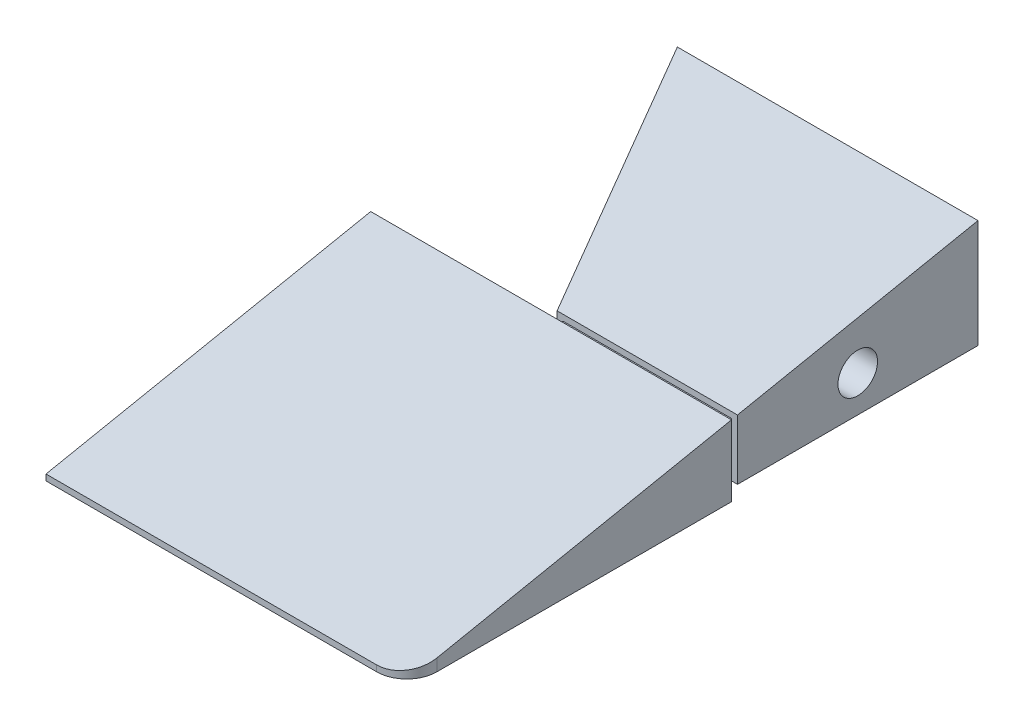
ISO-10303-21;
HEADER;
FILE_DESCRIPTION(('STEP AP214'),'2;1');
FILE_NAME('part.step','',(''),(''),'','','');
FILE_SCHEMA(('AUTOMOTIVE_DESIGN { 1 0 10303 214 1 1 1 1 }'));
ENDSEC;
DATA;
#1=APPLICATION_CONTEXT('core data for automotive mechanical design processes');
#2=APPLICATION_PROTOCOL_DEFINITION('international standard','automotive_design',2000,#1);
#3=PRODUCT_CONTEXT('',#1,'mechanical');
#4=PRODUCT('Part','Part','',(#3));
#5=PRODUCT_RELATED_PRODUCT_CATEGORY('part','',(#4));
#6=PRODUCT_DEFINITION_FORMATION('','',#4);
#7=PRODUCT_DEFINITION_CONTEXT('part definition',#1,'design');
#8=PRODUCT_DEFINITION('design','',#6,#7);
#9=PRODUCT_DEFINITION_SHAPE('','',#8);
#10=(LENGTH_UNIT() NAMED_UNIT(*) SI_UNIT(.MILLI.,.METRE.));
#11=(NAMED_UNIT(*) PLANE_ANGLE_UNIT() SI_UNIT($,.RADIAN.));
#12=(NAMED_UNIT(*) SI_UNIT($,.STERADIAN.) SOLID_ANGLE_UNIT());
#13=UNCERTAINTY_MEASURE_WITH_UNIT(LENGTH_MEASURE(1.E-05),#10,'distance_accuracy_value','');
#14=(GEOMETRIC_REPRESENTATION_CONTEXT(3) GLOBAL_UNCERTAINTY_ASSIGNED_CONTEXT((#13)) GLOBAL_UNIT_ASSIGNED_CONTEXT((#10,
#11,#12)) REPRESENTATION_CONTEXT('',''));
#15=CARTESIAN_POINT('',(0.,0.,0.));
#16=DIRECTION('',(0.,0.,1.));
#17=DIRECTION('',(1.,0.,0.));
#18=AXIS2_PLACEMENT_3D('',#15,#16,#17);
#19=CARTESIAN_POINT('',(35.,-10.001,41.));
#20=DIRECTION('',(0.,0.,-1.));
#21=DIRECTION('',(-1.,0.,0.));
#22=AXIS2_PLACEMENT_3D('',#19,#20,#21);
#23=PLANE('',#22);
#24=DIRECTION('',(-1.,0.,0.));
#25=VECTOR('',#24,1.);
#26=CARTESIAN_POINT('',(35.,1.79999999999998,41.));
#27=LINE('',#26,#25);
#28=CARTESIAN_POINT('',(65.,1.79999999999998,41.));
#29=VERTEX_POINT('',#28);
#30=CARTESIAN_POINT('',(5.,1.79999999999997,41.));
#31=VERTEX_POINT('',#30);
#32=EDGE_CURVE('E214',#29,#31,#27,.T.);
#33=ORIENTED_EDGE('',*,*,#32,.F.);
#34=DIRECTION('',(0.,-1.,0.));
#35=VECTOR('',#34,1.);
#36=CARTESIAN_POINT('',(65.,-10.,41.));
#37=LINE('',#36,#35);
#38=CARTESIAN_POINT('',(65.,-10.,41.));
#39=VERTEX_POINT('',#38);
#40=EDGE_CURVE('E192',#29,#39,#37,.T.);
#41=ORIENTED_EDGE('',*,*,#40,.T.);
#42=DIRECTION('',(1.,0.,0.));
#43=VECTOR('',#42,1.);
#44=CARTESIAN_POINT('',(35.,-10.,41.));
#45=LINE('',#44,#43);
#46=CARTESIAN_POINT('',(5.,-10.,41.));
#47=VERTEX_POINT('',#46);
#48=EDGE_CURVE('E221',#47,#39,#45,.T.);
#49=ORIENTED_EDGE('',*,*,#48,.F.);
#50=DIRECTION('',(0.,1.,0.));
#51=VECTOR('',#50,1.);
#52=CARTESIAN_POINT('',(5.,-10.001,41.));
#53=LINE('',#52,#51);
#54=EDGE_CURVE('E229',#47,#31,#53,.T.);
#55=ORIENTED_EDGE('',*,*,#54,.T.);
#56=EDGE_LOOP('',(#33,#41,#49,#55));
#57=FACE_BOUND('',#56,.T.);
#58=DIRECTION('',(-1.,0.,0.));
#59=VECTOR('',#58,1.);
#60=CARTESIAN_POINT('',(36.,-7.,41.));
#61=LINE('',#60,#59);
#62=CARTESIAN_POINT('',(64.,-7.,41.));
#63=VERTEX_POINT('',#62);
#64=CARTESIAN_POINT('',(36.,-7.,41.));
#65=VERTEX_POINT('',#64);
#66=EDGE_CURVE('E186',#63,#65,#61,.T.);
#67=ORIENTED_EDGE('',*,*,#66,.F.);
#68=DIRECTION('',(0.,-1.,0.));
#69=VECTOR('',#68,1.);
#70=CARTESIAN_POINT('',(64.,0.999999999999986,41.));
#71=LINE('',#70,#69);
#72=CARTESIAN_POINT('',(64.,0.999999999999986,41.));
#73=VERTEX_POINT('',#72);
#74=EDGE_CURVE('E178',#73,#63,#71,.T.);
#75=ORIENTED_EDGE('',*,*,#74,.F.);
#76=DIRECTION('',(1.,0.,0.));
#77=VECTOR('',#76,1.);
#78=CARTESIAN_POINT('',(36.,0.999999999999986,41.));
#79=LINE('',#78,#77);
#80=CARTESIAN_POINT('',(36.,0.999999999999986,41.));
#81=VERTEX_POINT('',#80);
#82=EDGE_CURVE('E182',#81,#73,#79,.T.);
#83=ORIENTED_EDGE('',*,*,#82,.F.);
#84=DIRECTION('',(0.,1.,0.));
#85=VECTOR('',#84,1.);
#86=CARTESIAN_POINT('',(36.,0.999999999999986,41.));
#87=LINE('',#86,#85);
#88=EDGE_CURVE('E184',#65,#81,#87,.T.);
#89=ORIENTED_EDGE('',*,*,#88,.F.);
#90=EDGE_LOOP('',(#67,#75,#83,#89));
#91=FACE_BOUND('',#90,.T.);
#92=ADVANCED_FACE('F34',(#57,#91),#23,.T.);
#93=CARTESIAN_POINT('',(60.,0.,90.));
#94=DIRECTION('',(0.,-1.,0.));
#95=DIRECTION('',(0.,0.,-1.));
#96=AXIS2_PLACEMENT_3D('',#93,#94,#95);
#97=CYLINDRICAL_SURFACE('',#96,5.);
#98=CARTESIAN_POINT('',(60.,-10.,90.));
#99=DIRECTION('',(0.,1.,0.));
#100=DIRECTION('',(0.,0.,1.));
#101=AXIS2_PLACEMENT_3D('',#98,#99,#100);
#102=CIRCLE('',#101,5.);
#103=CARTESIAN_POINT('',(65.,-10.,90.));
#104=VERTEX_POINT('',#103);
#105=CARTESIAN_POINT('',(60.,-10.,95.));
#106=VERTEX_POINT('',#105);
#107=EDGE_CURVE('E42',#104,#106,#102,.F.);
#108=ORIENTED_EDGE('',*,*,#107,.F.);
#109=DIRECTION('',(0.,1.,0.));
#110=VECTOR('',#109,1.);
#111=CARTESIAN_POINT('',(65.,-10.,90.));
#112=LINE('',#111,#110);
#113=CARTESIAN_POINT('',(65.,-8.,90.));
#114=VERTEX_POINT('',#113);
#115=EDGE_CURVE('E244',#114,#104,#112,.F.);
#116=ORIENTED_EDGE('',*,*,#115,.F.);
#117=CARTESIAN_POINT('',(60.,-8.,90.));
#118=DIRECTION('',(0.,-0.98058067569092,-0.196116135138184));
#119=DIRECTION('',(0.,-0.196116135138184,0.98058067569092));
#120=AXIS2_PLACEMENT_3D('',#117,#118,#119);
#121=ELLIPSE('',#120,5.09901951359278,5.);
#122=CARTESIAN_POINT('',(60.,-9.,95.));
#123=VERTEX_POINT('',#122);
#124=EDGE_CURVE('E241',#123,#114,#121,.F.);
#125=ORIENTED_EDGE('',*,*,#124,.F.);
#126=DIRECTION('',(0.,1.,0.));
#127=VECTOR('',#126,1.);
#128=CARTESIAN_POINT('',(60.,-9.,95.));
#129=LINE('',#128,#127);
#130=EDGE_CURVE('E238',#106,#123,#129,.T.);
#131=ORIENTED_EDGE('',*,*,#130,.F.);
#132=EDGE_LOOP('',(#108,#116,#125,#131));
#133=FACE_BOUND('',#132,.T.);
#134=ADVANCED_FACE('F36',(#133),#97,.T.);
#135=CARTESIAN_POINT('',(0.,0.,95.));
#136=DIRECTION('',(0.,0.,1.));
#137=DIRECTION('',(1.,0.,0.));
#138=AXIS2_PLACEMENT_3D('',#135,#136,#137);
#139=PLANE('',#138);
#140=DIRECTION('',(1.,0.,0.));
#141=VECTOR('',#140,1.);
#142=CARTESIAN_POINT('',(-65.,-10.,95.));
#143=LINE('',#142,#141);
#144=CARTESIAN_POINT('',(5.,-10.,95.));
#145=VERTEX_POINT('',#144);
#146=EDGE_CURVE('E232',#145,#106,#143,.T.);
#147=ORIENTED_EDGE('',*,*,#146,.T.);
#148=ORIENTED_EDGE('',*,*,#130,.T.);
#149=DIRECTION('',(-1.,0.,0.));
#150=VECTOR('',#149,1.);
#151=CARTESIAN_POINT('',(282.658902631417,-8.99999999999993,95.));
#152=LINE('',#151,#150);
#153=CARTESIAN_POINT('',(5.,-9.00000000000002,95.));
#154=VERTEX_POINT('',#153);
#155=EDGE_CURVE('E212',#123,#154,#152,.T.);
#156=ORIENTED_EDGE('',*,*,#155,.T.);
#157=DIRECTION('',(0.,1.,0.));
#158=VECTOR('',#157,1.);
#159=CARTESIAN_POINT('',(5.,-10.001,95.));
#160=LINE('',#159,#158);
#161=EDGE_CURVE('E226',#145,#154,#160,.T.);
#162=ORIENTED_EDGE('',*,*,#161,.F.);
#163=EDGE_LOOP('',(#147,#148,#156,#162));
#164=FACE_BOUND('',#163,.T.);
#165=ADVANCED_FACE('F255',(#164),#139,.T.);
#166=CARTESIAN_POINT('',(5.,-10.001,41.));
#167=DIRECTION('',(-1.,0.,0.));
#168=DIRECTION('',(0.,0.,1.));
#169=AXIS2_PLACEMENT_3D('',#166,#167,#168);
#170=PLANE('',#169);
#171=DIRECTION('',(0.,-0.196116135138184,0.98058067569092));
#172=VECTOR('',#171,1.);
#173=CARTESIAN_POINT('',(5.,1.34611538461536,43.2694230769231));
#174=LINE('',#173,#172);
#175=EDGE_CURVE('E216',#31,#154,#174,.T.);
#176=ORIENTED_EDGE('',*,*,#175,.F.);
#177=ORIENTED_EDGE('',*,*,#54,.F.);
#178=DIRECTION('',(0.,0.,-1.));
#179=VECTOR('',#178,1.);
#180=CARTESIAN_POINT('',(5.,-10.,41.));
#181=LINE('',#180,#179);
#182=EDGE_CURVE('E223',#145,#47,#181,.T.);
#183=ORIENTED_EDGE('',*,*,#182,.F.);
#184=ORIENTED_EDGE('',*,*,#161,.T.);
#185=EDGE_LOOP('',(#176,#177,#183,#184));
#186=FACE_BOUND('',#185,.T.);
#187=ADVANCED_FACE('F262',(#186),#170,.T.);
#188=CARTESIAN_POINT('',(282.658902631417,10.0000000000001,0.));
#189=DIRECTION('',(0.,-0.98058067569092,-0.196116135138184));
#190=DIRECTION('',(0.,0.196116135138184,-0.98058067569092));
#191=AXIS2_PLACEMENT_3D('',#188,#189,#190);
#192=PLANE('',#191);
#193=DIRECTION('',(0.,-0.196116135138184,0.98058067569092));
#194=VECTOR('',#193,1.);
#195=CARTESIAN_POINT('',(65.,-8.26923076923077,91.3461538461539));
#196=LINE('',#195,#194);
#197=EDGE_CURVE('E219',#29,#114,#196,.T.);
#198=ORIENTED_EDGE('',*,*,#197,.F.);
#199=ORIENTED_EDGE('',*,*,#32,.T.);
#200=ORIENTED_EDGE('',*,*,#175,.T.);
#201=ORIENTED_EDGE('',*,*,#155,.F.);
#202=ORIENTED_EDGE('',*,*,#124,.T.);
#203=EDGE_LOOP('',(#198,#199,#200,#201,#202));
#204=FACE_BOUND('',#203,.T.);
#205=ADVANCED_FACE('F259',(#204),#192,.F.);
#206=CARTESIAN_POINT('',(65.,10.,95.));
#207=DIRECTION('',(-1.,0.,0.));
#208=DIRECTION('',(0.,0.,1.));
#209=AXIS2_PLACEMENT_3D('',#206,#207,#208);
#210=PLANE('',#209);
#211=DIRECTION('',(0.,0.,-1.));
#212=VECTOR('',#211,1.);
#213=CARTESIAN_POINT('',(65.,-10.,95.));
#214=LINE('',#213,#212);
#215=EDGE_CURVE('E235',#104,#39,#214,.T.);
#216=ORIENTED_EDGE('',*,*,#215,.T.);
#217=ORIENTED_EDGE('',*,*,#40,.F.);
#218=ORIENTED_EDGE('',*,*,#197,.T.);
#219=ORIENTED_EDGE('',*,*,#115,.T.);
#220=EDGE_LOOP('',(#216,#217,#218,#219));
#221=FACE_BOUND('',#220,.T.);
#222=ADVANCED_FACE('F268',(#221),#210,.F.);
#223=CARTESIAN_POINT('',(-65.,-10.,95.));
#224=DIRECTION('',(0.,1.,0.));
#225=DIRECTION('',(0.,0.,1.));
#226=AXIS2_PLACEMENT_3D('',#223,#224,#225);
#227=PLANE('',#226);
#228=ORIENTED_EDGE('',*,*,#48,.T.);
#229=ORIENTED_EDGE('',*,*,#215,.F.);
#230=ORIENTED_EDGE('',*,*,#107,.T.);
#231=ORIENTED_EDGE('',*,*,#146,.F.);
#232=ORIENTED_EDGE('',*,*,#182,.T.);
#233=EDGE_LOOP('',(#228,#229,#230,#231,#232));
#234=FACE_BOUND('',#233,.T.);
#235=ADVANCED_FACE('F249',(#234),#227,.F.);
#236=CARTESIAN_POINT('',(64.,0.999999999999986,95.002));
#237=DIRECTION('',(-1.,0.,0.));
#238=DIRECTION('',(0.,0.,1.));
#239=AXIS2_PLACEMENT_3D('',#236,#237,#238);
#240=PLANE('',#239);
#241=DIRECTION('',(0.,0.,-1.));
#242=VECTOR('',#241,1.);
#243=CARTESIAN_POINT('',(64.,0.999999999999986,95.002));
#244=LINE('',#243,#242);
#245=CARTESIAN_POINT('',(64.,0.999999999999986,40.));
#246=VERTEX_POINT('',#245);
#247=EDGE_CURVE('E188',#73,#246,#244,.T.);
#248=ORIENTED_EDGE('',*,*,#247,.F.);
#249=ORIENTED_EDGE('',*,*,#74,.T.);
#250=DIRECTION('',(0.,0.,-1.));
#251=VECTOR('',#250,1.);
#252=CARTESIAN_POINT('',(64.,-7.,95.002));
#253=LINE('',#252,#251);
#254=CARTESIAN_POINT('',(64.,-7.,40.));
#255=VERTEX_POINT('',#254);
#256=EDGE_CURVE('E56',#63,#255,#253,.T.);
#257=ORIENTED_EDGE('',*,*,#256,.T.);
#258=DIRECTION('',(0.,1.,0.));
#259=VECTOR('',#258,1.);
#260=CARTESIAN_POINT('',(64.,0.999999999999986,40.));
#261=LINE('',#260,#259);
#262=EDGE_CURVE('E189',#255,#246,#261,.T.);
#263=ORIENTED_EDGE('',*,*,#262,.T.);
#264=EDGE_LOOP('',(#248,#249,#257,#263));
#265=FACE_BOUND('',#264,.T.);
#266=ADVANCED_FACE('F274',(#265),#240,.F.);
#267=CARTESIAN_POINT('',(36.,0.999999999999986,95.002));
#268=DIRECTION('',(0.,-1.,0.));
#269=DIRECTION('',(0.,0.,-1.));
#270=AXIS2_PLACEMENT_3D('',#267,#268,#269);
#271=PLANE('',#270);
#272=DIRECTION('',(0.,0.,-1.));
#273=VECTOR('',#272,1.);
#274=CARTESIAN_POINT('',(36.,0.999999999999986,95.002));
#275=LINE('',#274,#273);
#276=CARTESIAN_POINT('',(36.,0.999999999999986,40.));
#277=VERTEX_POINT('',#276);
#278=EDGE_CURVE('E203',#81,#277,#275,.T.);
#279=ORIENTED_EDGE('',*,*,#278,.F.);
#280=ORIENTED_EDGE('',*,*,#82,.T.);
#281=ORIENTED_EDGE('',*,*,#247,.T.);
#282=DIRECTION('',(-1.,0.,0.));
#283=VECTOR('',#282,1.);
#284=CARTESIAN_POINT('',(36.,0.999999999999986,40.));
#285=LINE('',#284,#283);
#286=EDGE_CURVE('E194',#246,#277,#285,.T.);
#287=ORIENTED_EDGE('',*,*,#286,.T.);
#288=EDGE_LOOP('',(#279,#280,#281,#287));
#289=FACE_BOUND('',#288,.T.);
#290=ADVANCED_FACE('F324',(#289),#271,.F.);
#291=CARTESIAN_POINT('',(36.,0.999999999999986,95.002));
#292=DIRECTION('',(1.,0.,0.));
#293=DIRECTION('',(0.,0.,-1.));
#294=AXIS2_PLACEMENT_3D('',#291,#292,#293);
#295=PLANE('',#294);
#296=DIRECTION('',(0.,0.,-1.));
#297=VECTOR('',#296,1.);
#298=CARTESIAN_POINT('',(36.,-7.,95.002));
#299=LINE('',#298,#297);
#300=CARTESIAN_POINT('',(36.,-7.,40.));
#301=VERTEX_POINT('',#300);
#302=EDGE_CURVE('E206',#65,#301,#299,.T.);
#303=ORIENTED_EDGE('',*,*,#302,.F.);
#304=ORIENTED_EDGE('',*,*,#88,.T.);
#305=ORIENTED_EDGE('',*,*,#278,.T.);
#306=DIRECTION('',(0.,-1.,0.));
#307=VECTOR('',#306,1.);
#308=CARTESIAN_POINT('',(36.,0.999999999999986,40.));
#309=LINE('',#308,#307);
#310=EDGE_CURVE('E197',#277,#301,#309,.T.);
#311=ORIENTED_EDGE('',*,*,#310,.T.);
#312=EDGE_LOOP('',(#303,#304,#305,#311));
#313=FACE_BOUND('',#312,.T.);
#314=ADVANCED_FACE('F336',(#313),#295,.F.);
#315=CARTESIAN_POINT('',(36.,-7.,95.002));
#316=DIRECTION('',(0.,1.,0.));
#317=DIRECTION('',(0.,0.,1.));
#318=AXIS2_PLACEMENT_3D('',#315,#316,#317);
#319=PLANE('',#318);
#320=ORIENTED_EDGE('',*,*,#256,.F.);
#321=ORIENTED_EDGE('',*,*,#66,.T.);
#322=ORIENTED_EDGE('',*,*,#302,.T.);
#323=DIRECTION('',(1.,0.,0.));
#324=VECTOR('',#323,1.);
#325=CARTESIAN_POINT('',(36.,-7.,40.));
#326=LINE('',#325,#324);
#327=EDGE_CURVE('E193',#301,#255,#326,.T.);
#328=ORIENTED_EDGE('',*,*,#327,.T.);
#329=EDGE_LOOP('',(#320,#321,#322,#328));
#330=FACE_BOUND('',#329,.T.);
#331=ADVANCED_FACE('F276',(#330),#319,.F.);
#332=CARTESIAN_POINT('',(65.,10.,95.));
#333=DIRECTION('',(-1.,0.,0.));
#334=DIRECTION('',(0.,0.,1.));
#335=AXIS2_PLACEMENT_3D('',#332,#333,#334);
#336=PLANE('',#335);
#337=CARTESIAN_POINT('',(65.,-1.945,20.));
#338=DIRECTION('',(1.,0.,0.));
#339=DIRECTION('',(0.,0.,-1.));
#340=AXIS2_PLACEMENT_3D('',#337,#338,#339);
#341=CIRCLE('',#340,3.2899985);
#342=CARTESIAN_POINT('',(65.,-1.945,16.7100015));
#343=VERTEX_POINT('',#342);
#344=EDGE_CURVE('E165',#343,#343,#341,.T.);
#345=ORIENTED_EDGE('',*,*,#344,.F.);
#346=EDGE_LOOP('',(#345));
#347=FACE_BOUND('',#346,.T.);
#348=DIRECTION('',(0.,1.,0.));
#349=VECTOR('',#348,1.);
#350=CARTESIAN_POINT('',(65.,1.99999999999999,40.));
#351=LINE('',#350,#349);
#352=CARTESIAN_POINT('',(65.,-8.,40.));
#353=VERTEX_POINT('',#352);
#354=CARTESIAN_POINT('',(65.,1.99999999999999,40.));
#355=VERTEX_POINT('',#354);
#356=EDGE_CURVE('E174',#353,#355,#351,.T.);
#357=ORIENTED_EDGE('',*,*,#356,.F.);
#358=DIRECTION('',(0.,0.,-1.));
#359=VECTOR('',#358,1.);
#360=CARTESIAN_POINT('',(65.,-8.,40.5));
#361=LINE('',#360,#359);
#362=CARTESIAN_POINT('',(65.,-8.,0.));
#363=VERTEX_POINT('',#362);
#364=EDGE_CURVE('E49',#353,#363,#361,.T.);
#365=ORIENTED_EDGE('',*,*,#364,.T.);
#366=DIRECTION('',(0.,1.,0.));
#367=VECTOR('',#366,1.);
#368=CARTESIAN_POINT('',(65.,10.,0.));
#369=LINE('',#368,#367);
#370=CARTESIAN_POINT('',(65.,9.99999999999998,0.));
#371=VERTEX_POINT('',#370);
#372=EDGE_CURVE('E148',#363,#371,#369,.T.);
#373=ORIENTED_EDGE('',*,*,#372,.T.);
#374=DIRECTION('',(0.,-0.196116135138184,0.98058067569092));
#375=VECTOR('',#374,1.);
#376=CARTESIAN_POINT('',(65.,-8.26923076923077,91.3461538461539));
#377=LINE('',#376,#375);
#378=EDGE_CURVE('E140',#371,#355,#377,.T.);
#379=ORIENTED_EDGE('',*,*,#378,.T.);
#380=EDGE_LOOP('',(#357,#365,#373,#379));
#381=FACE_BOUND('',#380,.T.);
#382=ADVANCED_FACE('F327',(#347,#381),#336,.F.);
#383=CARTESIAN_POINT('',(282.658902631417,10.0000000000001,0.));
#384=DIRECTION('',(0.,-0.98058067569092,-0.196116135138184));
#385=DIRECTION('',(0.,0.196116135138184,-0.98058067569092));
#386=AXIS2_PLACEMENT_3D('',#383,#384,#385);
#387=PLANE('',#386);
#388=DIRECTION('',(-0.440225453162812,0.176090181265125,-0.880450906325624));
#389=VECTOR('',#388,1.);
#390=CARTESIAN_POINT('',(35.9303100775194,1.62787596899224,41.8606201550388));
#391=LINE('',#390,#389);
#392=CARTESIAN_POINT('',(35.,1.99999999999999,40.));
#393=VERTEX_POINT('',#392);
#394=CARTESIAN_POINT('',(15.,10.,0.));
#395=VERTEX_POINT('',#394);
#396=EDGE_CURVE('E153',#393,#395,#391,.T.);
#397=ORIENTED_EDGE('',*,*,#396,.F.);
#398=DIRECTION('',(1.,0.,0.));
#399=VECTOR('',#398,1.);
#400=CARTESIAN_POINT('',(4.999,1.99999999999999,40.));
#401=LINE('',#400,#399);
#402=EDGE_CURVE('E158',#393,#355,#401,.T.);
#403=ORIENTED_EDGE('',*,*,#402,.T.);
#404=ORIENTED_EDGE('',*,*,#378,.F.);
#405=DIRECTION('',(-1.,0.,0.));
#406=VECTOR('',#405,1.);
#407=CARTESIAN_POINT('',(-65.,10.,0.));
#408=LINE('',#407,#406);
#409=EDGE_CURVE('E155',#371,#395,#408,.T.);
#410=ORIENTED_EDGE('',*,*,#409,.T.);
#411=EDGE_LOOP('',(#397,#403,#404,#410));
#412=FACE_BOUND('',#411,.T.);
#413=ADVANCED_FACE('F361',(#412),#387,.F.);
#414=CARTESIAN_POINT('',(0.,0.,0.));
#415=DIRECTION('',(0.,0.,1.));
#416=DIRECTION('',(1.,0.,0.));
#417=AXIS2_PLACEMENT_3D('',#414,#415,#416);
#418=PLANE('',#417);
#419=ORIENTED_EDGE('',*,*,#372,.F.);
#420=DIRECTION('',(1.,0.,0.));
#421=VECTOR('',#420,1.);
#422=CARTESIAN_POINT('',(65.,-8.,0.));
#423=LINE('',#422,#421);
#424=CARTESIAN_POINT('',(15.,-8.,0.));
#425=VERTEX_POINT('',#424);
#426=EDGE_CURVE('E136',#425,#363,#423,.T.);
#427=ORIENTED_EDGE('',*,*,#426,.F.);
#428=DIRECTION('',(0.,1.,0.));
#429=VECTOR('',#428,1.);
#430=CARTESIAN_POINT('',(15.,-10.001,0.));
#431=LINE('',#430,#429);
#432=EDGE_CURVE('E146',#425,#395,#431,.T.);
#433=ORIENTED_EDGE('',*,*,#432,.T.);
#434=ORIENTED_EDGE('',*,*,#409,.F.);
#435=EDGE_LOOP('',(#419,#427,#433,#434));
#436=FACE_BOUND('',#435,.T.);
#437=ADVANCED_FACE('F144',(#436),#418,.F.);
#438=CARTESIAN_POINT('',(35.,-10.001,40.));
#439=DIRECTION('',(0.894427190999916,0.,-0.447213595499958));
#440=DIRECTION('',(-0.447213595499958,0.,-0.894427190999916));
#441=AXIS2_PLACEMENT_3D('',#438,#439,#440);
#442=PLANE('',#441);
#443=CARTESIAN_POINT('',(23.9442719099992,-1.945,17.8885438199983));
#444=DIRECTION('',(-0.894427190999916,0.,0.447213595499958));
#445=DIRECTION('',(0.447213595499958,0.,0.894427190999916));
#446=AXIS2_PLACEMENT_3D('',#443,#444,#445);
#447=CIRCLE('',#446,3.28999849999999);
#448=CARTESIAN_POINT('',(25.4156039683736,-1.945,20.8312079367473));
#449=VERTEX_POINT('',#448);
#450=EDGE_CURVE('E171',#449,#449,#447,.T.);
#451=ORIENTED_EDGE('',*,*,#450,.F.);
#452=EDGE_LOOP('',(#451));
#453=FACE_BOUND('',#452,.T.);
#454=ORIENTED_EDGE('',*,*,#432,.F.);
#455=DIRECTION('',(0.447213595499958,0.,0.894427190999916));
#456=VECTOR('',#455,1.);
#457=CARTESIAN_POINT('',(35.,-8.,40.));
#458=LINE('',#457,#456);
#459=CARTESIAN_POINT('',(35.,-8.,40.));
#460=VERTEX_POINT('',#459);
#461=EDGE_CURVE('E133',#425,#460,#458,.T.);
#462=ORIENTED_EDGE('',*,*,#461,.T.);
#463=DIRECTION('',(0.,1.,0.));
#464=VECTOR('',#463,1.);
#465=CARTESIAN_POINT('',(35.,-10.001,40.));
#466=LINE('',#465,#464);
#467=EDGE_CURVE('E154',#460,#393,#466,.T.);
#468=ORIENTED_EDGE('',*,*,#467,.T.);
#469=ORIENTED_EDGE('',*,*,#396,.T.);
#470=EDGE_LOOP('',(#454,#462,#468,#469));
#471=FACE_BOUND('',#470,.T.);
#472=ADVANCED_FACE('F151',(#453,#471),#442,.F.);
#473=CARTESIAN_POINT('',(55.,-1.945,20.));
#474=DIRECTION('',(1.,0.,0.));
#475=DIRECTION('',(0.,0.,-1.));
#476=AXIS2_PLACEMENT_3D('',#473,#474,#475);
#477=CONICAL_SURFACE('',#476,3.2899985,1.02974425867665);
#478=CARTESIAN_POINT('',(53.0231694646903,-1.945,20.));
#479=VERTEX_POINT('',#478);
#480=VERTEX_LOOP('',#479);
#481=FACE_BOUND('',#480,.T.);
#482=CARTESIAN_POINT('',(55.,-1.945,20.));
#483=DIRECTION('',(1.,0.,0.));
#484=DIRECTION('',(0.,0.,-1.));
#485=AXIS2_PLACEMENT_3D('',#482,#483,#484);
#486=CIRCLE('',#485,3.2899985);
#487=CARTESIAN_POINT('',(55.,-1.945,16.7100015));
#488=VERTEX_POINT('',#487);
#489=EDGE_CURVE('E162',#488,#488,#486,.T.);
#490=ORIENTED_EDGE('',*,*,#489,.T.);
#491=EDGE_LOOP('',(#490));
#492=FACE_BOUND('',#491,.T.);
#493=ADVANCED_FACE('F373',(#481,#492),#477,.F.);
#494=CARTESIAN_POINT('',(65.,-1.945,20.));
#495=DIRECTION('',(1.,0.,0.));
#496=DIRECTION('',(0.,0.,-1.));
#497=AXIS2_PLACEMENT_3D('',#494,#495,#496);
#498=CYLINDRICAL_SURFACE('',#497,3.2899985);
#499=ORIENTED_EDGE('',*,*,#489,.F.);
#500=EDGE_LOOP('',(#499));
#501=FACE_BOUND('',#500,.T.);
#502=ORIENTED_EDGE('',*,*,#344,.T.);
#503=EDGE_LOOP('',(#502));
#504=FACE_BOUND('',#503,.T.);
#505=ADVANCED_FACE('F378',(#501,#504),#498,.F.);
#506=CARTESIAN_POINT('',(32.8885438199983,-1.945,13.4164078649987));
#507=DIRECTION('',(-0.894427190999916,0.,0.447213595499958));
#508=DIRECTION('',(0.447213595499958,0.,0.894427190999916));
#509=AXIS2_PLACEMENT_3D('',#506,#507,#508);
#510=CONICAL_SURFACE('',#509,3.28999849999999,1.02974425867665);
#511=CARTESIAN_POINT('',(34.6566748027783,-1.945,12.5323423736088));
#512=VERTEX_POINT('',#511);
#513=VERTEX_LOOP('',#512);
#514=FACE_BOUND('',#513,.T.);
#515=CARTESIAN_POINT('',(32.8885438199983,-1.945,13.4164078649987));
#516=DIRECTION('',(-0.894427190999916,0.,0.447213595499958));
#517=DIRECTION('',(0.447213595499958,0.,0.894427190999916));
#518=AXIS2_PLACEMENT_3D('',#515,#516,#517);
#519=CIRCLE('',#518,3.28999849999999);
#520=CARTESIAN_POINT('',(34.3598758783728,-1.945,16.3590719817477));
#521=VERTEX_POINT('',#520);
#522=EDGE_CURVE('E168',#521,#521,#519,.T.);
#523=ORIENTED_EDGE('',*,*,#522,.T.);
#524=EDGE_LOOP('',(#523));
#525=FACE_BOUND('',#524,.T.);
#526=ADVANCED_FACE('F390',(#514,#525),#510,.F.);
#527=CARTESIAN_POINT('',(23.9442719099992,-1.945,17.8885438199983));
#528=DIRECTION('',(-0.894427190999916,0.,0.447213595499958));
#529=DIRECTION('',(0.447213595499958,0.,0.894427190999916));
#530=AXIS2_PLACEMENT_3D('',#527,#528,#529);
#531=CYLINDRICAL_SURFACE('',#530,3.28999849999999);
#532=ORIENTED_EDGE('',*,*,#522,.F.);
#533=EDGE_LOOP('',(#532));
#534=FACE_BOUND('',#533,.T.);
#535=ORIENTED_EDGE('',*,*,#450,.T.);
#536=EDGE_LOOP('',(#535));
#537=FACE_BOUND('',#536,.T.);
#538=ADVANCED_FACE('F400',(#534,#537),#531,.F.);
#539=CARTESIAN_POINT('',(4.999,1.99999999999999,40.));
#540=DIRECTION('',(0.,0.,-1.));
#541=DIRECTION('',(-1.,0.,0.));
#542=AXIS2_PLACEMENT_3D('',#539,#540,#541);
#543=PLANE('',#542);
#544=ORIENTED_EDGE('',*,*,#262,.F.);
#545=ORIENTED_EDGE('',*,*,#327,.F.);
#546=ORIENTED_EDGE('',*,*,#310,.F.);
#547=ORIENTED_EDGE('',*,*,#286,.F.);
#548=EDGE_LOOP('',(#544,#545,#546,#547));
#549=FACE_BOUND('',#548,.T.);
#550=ORIENTED_EDGE('',*,*,#467,.F.);
#551=DIRECTION('',(1.,0.,0.));
#552=VECTOR('',#551,1.);
#553=CARTESIAN_POINT('',(4.999,-8.,40.));
#554=LINE('',#553,#552);
#555=EDGE_CURVE('E11',#460,#353,#554,.T.);
#556=ORIENTED_EDGE('',*,*,#555,.T.);
#557=ORIENTED_EDGE('',*,*,#356,.T.);
#558=ORIENTED_EDGE('',*,*,#402,.F.);
#559=EDGE_LOOP('',(#550,#556,#557,#558));
#560=FACE_BOUND('',#559,.T.);
#561=ADVANCED_FACE('F410',(#549,#560),#543,.F.);
#562=CARTESIAN_POINT('',(65.,-8.,40.5));
#563=DIRECTION('',(0.,1.,0.));
#564=DIRECTION('',(0.,0.,1.));
#565=AXIS2_PLACEMENT_3D('',#562,#563,#564);
#566=PLANE('',#565);
#567=ORIENTED_EDGE('',*,*,#426,.T.);
#568=ORIENTED_EDGE('',*,*,#364,.F.);
#569=ORIENTED_EDGE('',*,*,#555,.F.);
#570=ORIENTED_EDGE('',*,*,#461,.F.);
#571=EDGE_LOOP('',(#567,#568,#569,#570));
#572=FACE_BOUND('',#571,.T.);
#573=ADVANCED_FACE('F135',(#572),#566,.F.);
#574=CLOSED_SHELL('',(#92,#134,#165,#187,#205,#222,#235,#266,#290,#314,#331,#382,#413,#437,#472,
#493,#505,#526,#538,#561,#573));
#575=MANIFOLD_SOLID_BREP('B2',#574);
#576=ADVANCED_BREP_SHAPE_REPRESENTATION('',(#18,#575),#14);
#577=SHAPE_DEFINITION_REPRESENTATION(#9,#576);
ENDSEC;
END-ISO-10303-21;
